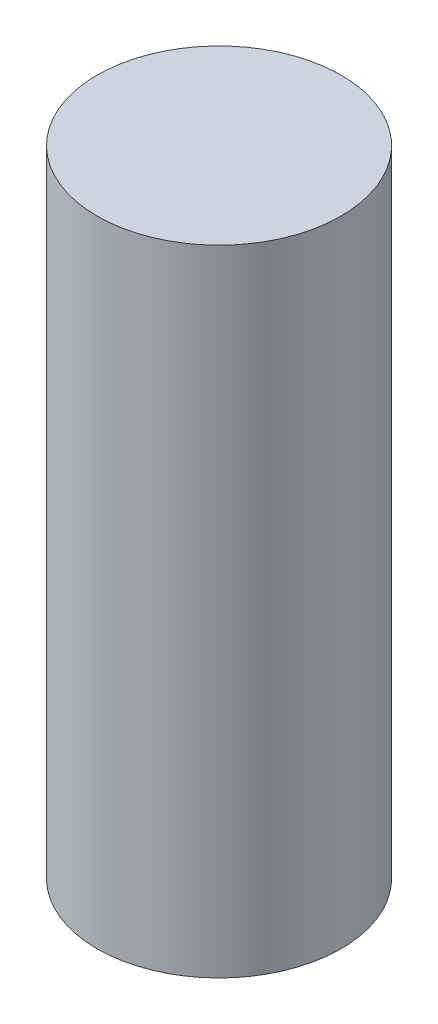
ISO-10303-21;
HEADER;
FILE_DESCRIPTION(('STEP AP214'),'2;1');
FILE_NAME('part.step','',(''),(''),'','','');
FILE_SCHEMA(('AUTOMOTIVE_DESIGN { 1 0 10303 214 1 1 1 1 }'));
ENDSEC;
DATA;
#1=APPLICATION_CONTEXT('core data for automotive mechanical design processes');
#2=APPLICATION_PROTOCOL_DEFINITION('international standard','automotive_design',2000,#1);
#3=PRODUCT_CONTEXT('',#1,'mechanical');
#4=PRODUCT('Part','Part','',(#3));
#5=PRODUCT_RELATED_PRODUCT_CATEGORY('part','',(#4));
#6=PRODUCT_DEFINITION_FORMATION('','',#4);
#7=PRODUCT_DEFINITION_CONTEXT('part definition',#1,'design');
#8=PRODUCT_DEFINITION('design','',#6,#7);
#9=PRODUCT_DEFINITION_SHAPE('','',#8);
#10=(LENGTH_UNIT() NAMED_UNIT(*) SI_UNIT(.MILLI.,.METRE.));
#11=(NAMED_UNIT(*) PLANE_ANGLE_UNIT() SI_UNIT($,.RADIAN.));
#12=(NAMED_UNIT(*) SI_UNIT($,.STERADIAN.) SOLID_ANGLE_UNIT());
#13=UNCERTAINTY_MEASURE_WITH_UNIT(LENGTH_MEASURE(1.E-05),#10,'distance_accuracy_value','');
#14=(GEOMETRIC_REPRESENTATION_CONTEXT(3) GLOBAL_UNCERTAINTY_ASSIGNED_CONTEXT((#13)) GLOBAL_UNIT_ASSIGNED_CONTEXT((#10,
#11,#12)) REPRESENTATION_CONTEXT('',''));
#15=CARTESIAN_POINT('',(0.,0.,0.));
#16=DIRECTION('',(0.,0.,1.));
#17=DIRECTION('',(1.,0.,0.));
#18=AXIS2_PLACEMENT_3D('',#15,#16,#17);
#19=CARTESIAN_POINT('',(0.,2.6,0.));
#20=DIRECTION('',(0.,-1.,0.));
#21=DIRECTION('',(0.,0.,-1.));
#22=AXIS2_PLACEMENT_3D('',#19,#20,#21);
#23=CYLINDRICAL_SURFACE('',#22,0.5);
#24=CARTESIAN_POINT('',(0.,2.6,0.));
#25=DIRECTION('',(0.,1.,0.));
#26=DIRECTION('',(0.,0.,1.));
#27=AXIS2_PLACEMENT_3D('',#24,#25,#26);
#28=CIRCLE('',#27,0.5);
#29=CARTESIAN_POINT('',(0.,2.6,0.5));
#30=VERTEX_POINT('',#29);
#31=EDGE_CURVE('E12',#30,#30,#28,.T.);
#32=ORIENTED_EDGE('',*,*,#31,.F.);
#33=EDGE_LOOP('',(#32));
#34=FACE_BOUND('',#33,.T.);
#35=CARTESIAN_POINT('',(0.,0.,0.));
#36=DIRECTION('',(0.,1.,0.));
#37=DIRECTION('',(0.,0.,1.));
#38=AXIS2_PLACEMENT_3D('',#35,#36,#37);
#39=CIRCLE('',#38,0.5);
#40=CARTESIAN_POINT('',(0.,0.,0.5));
#41=VERTEX_POINT('',#40);
#42=EDGE_CURVE('E43',#41,#41,#39,.T.);
#43=ORIENTED_EDGE('',*,*,#42,.T.);
#44=EDGE_LOOP('',(#43));
#45=FACE_BOUND('',#44,.T.);
#46=ADVANCED_FACE('F40',(#34,#45),#23,.T.);
#47=CARTESIAN_POINT('',(0.,2.6,0.));
#48=DIRECTION('',(0.,1.,0.));
#49=DIRECTION('',(0.,0.,1.));
#50=AXIS2_PLACEMENT_3D('',#47,#48,#49);
#51=PLANE('',#50);
#52=ORIENTED_EDGE('',*,*,#31,.T.);
#53=EDGE_LOOP('',(#52));
#54=FACE_BOUND('',#53,.T.);
#55=ADVANCED_FACE('F55',(#54),#51,.T.);
#56=CARTESIAN_POINT('',(0.,0.,0.));
#57=DIRECTION('',(0.,1.,0.));
#58=DIRECTION('',(0.,0.,1.));
#59=AXIS2_PLACEMENT_3D('',#56,#57,#58);
#60=PLANE('',#59);
#61=ORIENTED_EDGE('',*,*,#42,.F.);
#62=EDGE_LOOP('',(#61));
#63=FACE_BOUND('',#62,.T.);
#64=ADVANCED_FACE('F53',(#63),#60,.F.);
#65=CLOSED_SHELL('',(#46,#55,#64));
#66=MANIFOLD_SOLID_BREP('B2',#65);
#67=ADVANCED_BREP_SHAPE_REPRESENTATION('',(#18,#66),#14);
#68=SHAPE_DEFINITION_REPRESENTATION(#9,#67);
ENDSEC;
END-ISO-10303-21;
